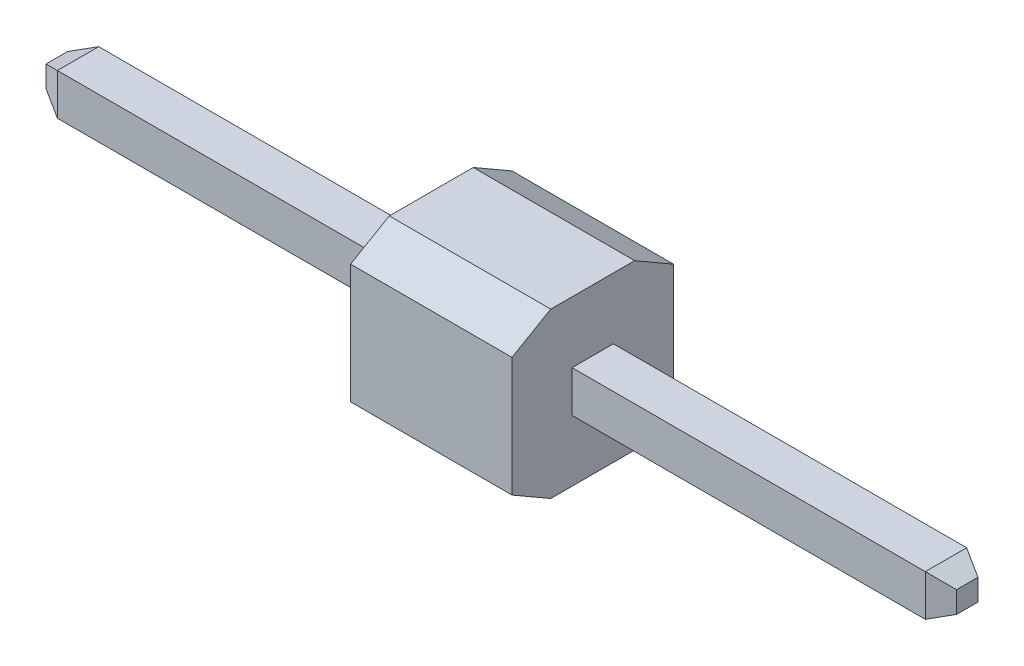
ISO-10303-21;
HEADER;
FILE_DESCRIPTION(('STEP AP214'),'2;1');
FILE_NAME('part.step','',(''),(''),'','','');
FILE_SCHEMA(('AUTOMOTIVE_DESIGN { 1 0 10303 214 1 1 1 1 }'));
ENDSEC;
DATA;
#1=APPLICATION_CONTEXT('core data for automotive mechanical design processes');
#2=APPLICATION_PROTOCOL_DEFINITION('international standard','automotive_design',2000,#1);
#3=PRODUCT_CONTEXT('',#1,'mechanical');
#4=PRODUCT('Part','Part','',(#3));
#5=PRODUCT_RELATED_PRODUCT_CATEGORY('part','',(#4));
#6=PRODUCT_DEFINITION_FORMATION('','',#4);
#7=PRODUCT_DEFINITION_CONTEXT('part definition',#1,'design');
#8=PRODUCT_DEFINITION('design','',#6,#7);
#9=PRODUCT_DEFINITION_SHAPE('','',#8);
#10=(LENGTH_UNIT() NAMED_UNIT(*) SI_UNIT(.MILLI.,.METRE.));
#11=(NAMED_UNIT(*) PLANE_ANGLE_UNIT() SI_UNIT($,.RADIAN.));
#12=(NAMED_UNIT(*) SI_UNIT($,.STERADIAN.) SOLID_ANGLE_UNIT());
#13=UNCERTAINTY_MEASURE_WITH_UNIT(LENGTH_MEASURE(1.E-05),#10,'distance_accuracy_value','');
#14=(GEOMETRIC_REPRESENTATION_CONTEXT(3) GLOBAL_UNCERTAINTY_ASSIGNED_CONTEXT((#13)) GLOBAL_UNIT_ASSIGNED_CONTEXT((#10,
#11,#12)) REPRESENTATION_CONTEXT('',''));
#15=CARTESIAN_POINT('',(0.,0.,0.));
#16=DIRECTION('',(0.,0.,1.));
#17=DIRECTION('',(1.,0.,0.));
#18=AXIS2_PLACEMENT_3D('',#15,#16,#17);
#19=CARTESIAN_POINT('',(5.42107439041138,12.3828784128063,0.629998634255617));
#20=DIRECTION('',(1.,4.37113882867379E-08,-4.37113882867379E-08));
#21=DIRECTION('',(-4.37113882867379E-08,1.,0.));
#22=AXIS2_PLACEMENT_3D('',#19,#20,#21);
#23=PLANE('',#22);
#24=DIRECTION('',(1.59994790123753E-08,0.50000000000019,0.866025403784329));
#25=VECTOR('',#24,1.);
#26=CARTESIAN_POINT('',(5.42107426742546,13.6264682512923,-0.940001365744382));
#27=LINE('',#26,#25);
#28=CARTESIAN_POINT('',(5.42107426742546,13.6264682512923,-0.940001365744382));
#29=VERTEX_POINT('',#28);
#30=CARTESIAN_POINT('',(5.42107427851022,13.9728784128063,-0.340001365744383));
#31=VERTEX_POINT('',#30);
#32=EDGE_CURVE('E11',#29,#31,#27,.T.);
#33=ORIENTED_EDGE('',*,*,#32,.T.);
#34=DIRECTION('',(4.37113886966664E-08,0.,0.999999999999999));
#35=VECTOR('',#34,1.);
#36=CARTESIAN_POINT('',(5.42107427851022,13.9728784128063,-0.340001365744383));
#37=LINE('',#36,#35);
#38=CARTESIAN_POINT('',(5.42107433533503,13.9728784128063,0.959998634255618));
#39=VERTEX_POINT('',#38);
#40=EDGE_CURVE('E304',#31,#39,#37,.T.);
#41=ORIENTED_EDGE('',*,*,#40,.T.);
#42=DIRECTION('',(5.97108656004285E-08,-0.500000000000188,0.866025403784328));
#43=VECTOR('',#42,1.);
#44=CARTESIAN_POINT('',(5.42107433533503,13.9728784128063,0.959998634255618));
#45=LINE('',#44,#43);
#46=CARTESIAN_POINT('',(5.42107437670393,13.6264682512923,1.55999863425562));
#47=VERTEX_POINT('',#46);
#48=EDGE_CURVE('E296',#39,#47,#45,.T.);
#49=ORIENTED_EDGE('',*,*,#48,.T.);
#50=DIRECTION('',(4.37113884815071E-08,-0.999999999999999,0.));
#51=VECTOR('',#50,1.);
#52=CARTESIAN_POINT('',(5.42107437670393,13.6264682512923,1.55999863425562));
#53=LINE('',#52,#51);
#54=CARTESIAN_POINT('',(5.42107445744672,11.7792885743203,1.55999863425562));
#55=VERTEX_POINT('',#54);
#56=EDGE_CURVE('E281',#47,#55,#53,.T.);
#57=ORIENTED_EDGE('',*,*,#56,.T.);
#58=DIRECTION('',(1.59994777304001E-08,0.50000000000019,0.866025403784329));
#59=VECTOR('',#58,1.);
#60=CARTESIAN_POINT('',(5.42107444636195,11.4328784128063,0.959998634255618));
#61=LINE('',#60,#59);
#62=CARTESIAN_POINT('',(5.42107444636195,11.4328784128063,0.959998634255618));
#63=VERTEX_POINT('',#62);
#64=EDGE_CURVE('E265',#63,#55,#61,.T.);
#65=ORIENTED_EDGE('',*,*,#64,.F.);
#66=DIRECTION('',(4.37113886966664E-08,0.,0.999999999999999));
#67=VECTOR('',#66,1.);
#68=CARTESIAN_POINT('',(5.42107438953715,11.4328784128063,-0.340001365744383));
#69=LINE('',#68,#67);
#70=CARTESIAN_POINT('',(5.42107438953715,11.4328784128063,-0.340001365744383));
#71=VERTEX_POINT('',#70);
#72=EDGE_CURVE('E248',#71,#63,#69,.T.);
#73=ORIENTED_EDGE('',*,*,#72,.F.);
#74=DIRECTION('',(5.97108668824036E-08,-0.500000000000188,0.866025403784328));
#75=VECTOR('',#74,1.);
#76=CARTESIAN_POINT('',(5.42107434816825,11.7792885743203,-0.940001365744382));
#77=LINE('',#76,#75);
#78=CARTESIAN_POINT('',(5.42107434816825,11.7792885743203,-0.940001365744382));
#79=VERTEX_POINT('',#78);
#80=EDGE_CURVE('E242',#79,#71,#77,.T.);
#81=ORIENTED_EDGE('',*,*,#80,.F.);
#82=DIRECTION('',(4.37113884815071E-08,-0.999999999999999,0.));
#83=VECTOR('',#82,1.);
#84=CARTESIAN_POINT('',(5.42107426742546,13.6264682512923,-0.940001365744382));
#85=LINE('',#84,#83);
#86=EDGE_CURVE('E236',#29,#79,#85,.T.);
#87=ORIENTED_EDGE('',*,*,#86,.F.);
#88=EDGE_LOOP('',(#33,#41,#49,#57,#65,#73,#81,#87));
#89=FACE_BOUND('',#88,.T.);
#90=DIRECTION('',(-4.37113900630947E-08,0.,-0.999999999999999));
#91=VECTOR('',#90,1.);
#92=CARTESIAN_POINT('',(5.42107436243609,13.0228784128063,0.629998634255617));
#93=LINE('',#92,#91);
#94=CARTESIAN_POINT('',(5.42107436243609,13.0228784128063,0.629998634255617));
#95=VERTEX_POINT('',#94);
#96=CARTESIAN_POINT('',(5.4210743344608,13.0228784128063,-0.0100013657443826));
#97=VERTEX_POINT('',#96);
#98=EDGE_CURVE('E302',#95,#97,#93,.T.);
#99=ORIENTED_EDGE('',*,*,#98,.T.);
#100=DIRECTION('',(-4.37113900630947E-08,0.999999999999999,0.));
#101=VECTOR('',#100,1.);
#102=CARTESIAN_POINT('',(5.42107436243609,12.3828784128063,-0.0100013657443826));
#103=LINE('',#102,#101);
#104=CARTESIAN_POINT('',(5.42107436243609,12.3828784128063,-0.0100013657443826));
#105=VERTEX_POINT('',#104);
#106=EDGE_CURVE('E293',#105,#97,#103,.T.);
#107=ORIENTED_EDGE('',*,*,#106,.F.);
#108=DIRECTION('',(-4.37113872875372E-08,0.,-0.999999999999999));
#109=VECTOR('',#108,1.);
#110=CARTESIAN_POINT('',(5.42107439041138,12.3828784128063,0.629998634255617));
#111=LINE('',#110,#109);
#112=CARTESIAN_POINT('',(5.42107439041138,12.3828784128063,0.629998634255617));
#113=VERTEX_POINT('',#112);
#114=EDGE_CURVE('E278',#113,#105,#111,.T.);
#115=ORIENTED_EDGE('',*,*,#114,.F.);
#116=DIRECTION('',(-4.37113872875371E-08,0.999999999999999,0.));
#117=VECTOR('',#116,1.);
#118=CARTESIAN_POINT('',(5.42107439041138,12.3828784128063,0.629998634255617));
#119=LINE('',#118,#117);
#120=EDGE_CURVE('E263',#113,#95,#119,.T.);
#121=ORIENTED_EDGE('',*,*,#120,.T.);
#122=EDGE_LOOP('',(#99,#107,#115,#121));
#123=FACE_BOUND('',#122,.T.);
#124=ADVANCED_FACE('F17',(#89,#123),#23,.T.);
#125=CARTESIAN_POINT('',(2.92107439041138,12.3828783035278,0.629998743534088));
#126=DIRECTION('',(1.,4.37113882867379E-08,-4.37113882867379E-08));
#127=DIRECTION('',(-4.37113882867379E-08,1.,0.));
#128=AXIS2_PLACEMENT_3D('',#125,#126,#127);
#129=PLANE('',#128);
#130=DIRECTION('',(1.59994783713877E-08,0.50000000000019,0.866025403784329));
#131=VECTOR('',#130,1.);
#132=CARTESIAN_POINT('',(2.92107426742546,13.6264681420138,-0.940001256465912));
#133=LINE('',#132,#131);
#134=CARTESIAN_POINT('',(2.92107426742546,13.6264681420138,-0.940001256465912));
#135=VERTEX_POINT('',#134);
#136=CARTESIAN_POINT('',(2.92107427851022,13.9728783035278,-0.340001256465912));
#137=VERTEX_POINT('',#136);
#138=EDGE_CURVE('E24',#135,#137,#133,.T.);
#139=ORIENTED_EDGE('',*,*,#138,.F.);
#140=DIRECTION('',(4.37113882410924E-08,-0.999999999999999,0.));
#141=VECTOR('',#140,1.);
#142=CARTESIAN_POINT('',(2.92107426742546,13.6264681420138,-0.940001256465912));
#143=LINE('',#142,#141);
#144=CARTESIAN_POINT('',(2.92107434816825,11.7792884650418,-0.940001256465912));
#145=VERTEX_POINT('',#144);
#146=EDGE_CURVE('E300',#135,#145,#143,.T.);
#147=ORIENTED_EDGE('',*,*,#146,.T.);
#148=DIRECTION('',(5.97108668824036E-08,-0.500000000000188,0.866025403784328));
#149=VECTOR('',#148,1.);
#150=CARTESIAN_POINT('',(2.92107434816825,11.7792884650418,-0.940001256465912));
#151=LINE('',#150,#149);
#152=CARTESIAN_POINT('',(2.92107438953715,11.4328783035278,-0.340001256465912));
#153=VERTEX_POINT('',#152);
#154=EDGE_CURVE('E286',#145,#153,#151,.T.);
#155=ORIENTED_EDGE('',*,*,#154,.T.);
#156=DIRECTION('',(4.37113883550593E-08,0.,0.999999999999999));
#157=VECTOR('',#156,1.);
#158=CARTESIAN_POINT('',(2.92107438953715,11.4328783035278,-0.340001256465912));
#159=LINE('',#158,#157);
#160=CARTESIAN_POINT('',(2.92107444636195,11.4328783035278,0.959998743534088));
#161=VERTEX_POINT('',#160);
#162=EDGE_CURVE('E271',#153,#161,#159,.T.);
#163=ORIENTED_EDGE('',*,*,#162,.T.);
#164=DIRECTION('',(1.59994783713877E-08,0.50000000000019,0.866025403784329));
#165=VECTOR('',#164,1.);
#166=CARTESIAN_POINT('',(2.92107444636195,11.4328783035278,0.959998743534088));
#167=LINE('',#166,#165);
#168=CARTESIAN_POINT('',(2.92107445744672,11.7792884650418,1.55999874353409));
#169=VERTEX_POINT('',#168);
#170=EDGE_CURVE('E253',#161,#169,#167,.T.);
#171=ORIENTED_EDGE('',*,*,#170,.T.);
#172=DIRECTION('',(4.37113882410924E-08,-0.999999999999999,0.));
#173=VECTOR('',#172,1.);
#174=CARTESIAN_POINT('',(2.92107437670393,13.6264681420138,1.55999874353409));
#175=LINE('',#174,#173);
#176=CARTESIAN_POINT('',(2.92107437670393,13.6264681420138,1.55999874353409));
#177=VERTEX_POINT('',#176);
#178=EDGE_CURVE('E261',#177,#169,#175,.T.);
#179=ORIENTED_EDGE('',*,*,#178,.F.);
#180=DIRECTION('',(5.97108668824036E-08,-0.500000000000188,0.866025403784328));
#181=VECTOR('',#180,1.);
#182=CARTESIAN_POINT('',(2.92107433533503,13.9728783035278,0.959998743534088));
#183=LINE('',#182,#181);
#184=CARTESIAN_POINT('',(2.92107433533503,13.9728783035278,0.959998743534088));
#185=VERTEX_POINT('',#184);
#186=EDGE_CURVE('E276',#185,#177,#183,.T.);
#187=ORIENTED_EDGE('',*,*,#186,.F.);
#188=DIRECTION('',(4.37113883550593E-08,0.,0.999999999999999));
#189=VECTOR('',#188,1.);
#190=CARTESIAN_POINT('',(2.92107427851022,13.9728783035278,-0.340001256465912));
#191=LINE('',#190,#189);
#192=EDGE_CURVE('E291',#137,#185,#191,.T.);
#193=ORIENTED_EDGE('',*,*,#192,.F.);
#194=EDGE_LOOP('',(#139,#147,#155,#163,#171,#179,#187,#193));
#195=FACE_BOUND('',#194,.T.);
#196=DIRECTION('',(-4.37113886753159E-08,0.999999999999999,0.));
#197=VECTOR('',#196,1.);
#198=CARTESIAN_POINT('',(2.92107436243609,12.3828783035278,-0.0100012564659119));
#199=LINE('',#198,#197);
#200=CARTESIAN_POINT('',(2.92107436243609,12.3828783035278,-0.0100012564659119));
#201=VERTEX_POINT('',#200);
#202=CARTESIAN_POINT('',(2.9210743344608,13.0228783035278,-0.0100012564659119));
#203=VERTEX_POINT('',#202);
#204=EDGE_CURVE('E298',#201,#203,#199,.T.);
#205=ORIENTED_EDGE('',*,*,#204,.T.);
#206=DIRECTION('',(-4.37113886753159E-08,0.,-0.999999999999999));
#207=VECTOR('',#206,1.);
#208=CARTESIAN_POINT('',(2.92107436243609,13.0228783035278,0.629998743534088));
#209=LINE('',#208,#207);
#210=CARTESIAN_POINT('',(2.92107436243609,13.0228783035278,0.629998743534088));
#211=VERTEX_POINT('',#210);
#212=EDGE_CURVE('E283',#211,#203,#209,.T.);
#213=ORIENTED_EDGE('',*,*,#212,.F.);
#214=DIRECTION('',(-4.37113879814265E-08,0.999999999999999,0.));
#215=VECTOR('',#214,1.);
#216=CARTESIAN_POINT('',(2.92107439041138,12.3828783035278,0.629998743534088));
#217=LINE('',#216,#215);
#218=CARTESIAN_POINT('',(2.92107439041138,12.3828783035278,0.629998743534088));
#219=VERTEX_POINT('',#218);
#220=EDGE_CURVE('E268',#219,#211,#217,.T.);
#221=ORIENTED_EDGE('',*,*,#220,.F.);
#222=DIRECTION('',(-4.37113879814266E-08,0.,-0.999999999999999));
#223=VECTOR('',#222,1.);
#224=CARTESIAN_POINT('',(2.92107439041138,12.3828783035278,0.629998743534088));
#225=LINE('',#224,#223);
#226=EDGE_CURVE('E251',#219,#201,#225,.T.);
#227=ORIENTED_EDGE('',*,*,#226,.T.);
#228=EDGE_LOOP('',(#205,#213,#221,#227));
#229=FACE_BOUND('',#228,.T.);
#230=ADVANCED_FACE('F314',(#195,#229),#129,.F.);
#231=CARTESIAN_POINT('',(5.42107426742546,13.6264682512923,-0.940001365744382));
#232=DIRECTION('',(5.97108668343731E-08,-0.866025403784328,0.50000000000019));
#233=DIRECTION('',(-1.59994785476185E-08,-0.500000000000192,-0.866025403784329));
#234=AXIS2_PLACEMENT_3D('',#231,#232,#233);
#235=PLANE('',#234);
#236=ORIENTED_EDGE('',*,*,#138,.T.);
#237=DIRECTION('',(-0.999999999999998,-4.37113882867378E-08,4.37113883755557E-08));
#238=VECTOR('',#237,1.);
#239=CARTESIAN_POINT('',(5.42107427851022,13.9728784128063,-0.340001365744383));
#240=LINE('',#239,#238);
#241=EDGE_CURVE('E288',#31,#137,#240,.T.);
#242=ORIENTED_EDGE('',*,*,#241,.F.);
#243=ORIENTED_EDGE('',*,*,#32,.F.);
#244=DIRECTION('',(-0.999999999999998,-4.37113882867378E-08,4.37113881091022E-08));
#245=VECTOR('',#244,1.);
#246=CARTESIAN_POINT('',(5.42107426742546,13.6264682512923,-0.940001365744382));
#247=LINE('',#246,#245);
#248=EDGE_CURVE('E256',#29,#135,#247,.T.);
#249=ORIENTED_EDGE('',*,*,#248,.T.);
#250=EDGE_LOOP('',(#236,#242,#243,#249));
#251=FACE_BOUND('',#250,.T.);
#252=ADVANCED_FACE('F306',(#251),#235,.F.);
#253=CARTESIAN_POINT('',(5.42107427851022,13.9728784128063,-0.340001365744383));
#254=DIRECTION('',(4.37113882867379E-08,-1.,0.));
#255=DIRECTION('',(1.,4.37113882867379E-08,-4.37113882867379E-08));
#256=AXIS2_PLACEMENT_3D('',#253,#254,#255);
#257=PLANE('',#256);
#258=ORIENTED_EDGE('',*,*,#192,.T.);
#259=DIRECTION('',(-0.999999999999998,-4.37113882867378E-08,4.37113882867378E-08));
#260=VECTOR('',#259,1.);
#261=CARTESIAN_POINT('',(5.42107433533503,13.9728784128063,0.959998634255618));
#262=LINE('',#261,#260);
#263=EDGE_CURVE('E273',#39,#185,#262,.T.);
#264=ORIENTED_EDGE('',*,*,#263,.F.);
#265=ORIENTED_EDGE('',*,*,#40,.F.);
#266=ORIENTED_EDGE('',*,*,#241,.T.);
#267=EDGE_LOOP('',(#258,#264,#265,#266));
#268=FACE_BOUND('',#267,.T.);
#269=ADVANCED_FACE('F311',(#268),#257,.F.);
#270=CARTESIAN_POINT('',(5.42107433533503,13.9728784128063,0.959998634255618));
#271=DIRECTION('',(1.59994785476185E-08,-0.86602540378433,-0.50000000000019));
#272=DIRECTION('',(-5.97108668343731E-08,0.500000000000188,-0.866025403784329));
#273=AXIS2_PLACEMENT_3D('',#270,#271,#272);
#274=PLANE('',#273);
#275=ORIENTED_EDGE('',*,*,#186,.T.);
#276=DIRECTION('',(-0.999999999999998,-4.37113882867378E-08,4.37113882867378E-08));
#277=VECTOR('',#276,1.);
#278=CARTESIAN_POINT('',(5.42107437670393,13.6264682512923,1.55999863425562));
#279=LINE('',#278,#277);
#280=EDGE_CURVE('E258',#47,#177,#279,.T.);
#281=ORIENTED_EDGE('',*,*,#280,.F.);
#282=ORIENTED_EDGE('',*,*,#48,.F.);
#283=ORIENTED_EDGE('',*,*,#263,.T.);
#284=EDGE_LOOP('',(#275,#281,#282,#283));
#285=FACE_BOUND('',#284,.T.);
#286=ADVANCED_FACE('F319',(#285),#274,.F.);
#287=CARTESIAN_POINT('',(5.42107437670393,13.6264682512923,1.55999863425562));
#288=DIRECTION('',(-4.37113882867379E-08,0.,-1.));
#289=DIRECTION('',(-1.,-4.37113882867379E-08,4.37113882867379E-08));
#290=AXIS2_PLACEMENT_3D('',#287,#288,#289);
#291=PLANE('',#290);
#292=ORIENTED_EDGE('',*,*,#178,.T.);
#293=DIRECTION('',(-0.999999999999998,-4.37113882867378E-08,4.37113882867378E-08));
#294=VECTOR('',#293,1.);
#295=CARTESIAN_POINT('',(5.42107445744672,11.7792885743203,1.55999863425562));
#296=LINE('',#295,#294);
#297=EDGE_CURVE('E245',#55,#169,#296,.T.);
#298=ORIENTED_EDGE('',*,*,#297,.F.);
#299=ORIENTED_EDGE('',*,*,#56,.F.);
#300=ORIENTED_EDGE('',*,*,#280,.T.);
#301=EDGE_LOOP('',(#292,#298,#299,#300));
#302=FACE_BOUND('',#301,.T.);
#303=ADVANCED_FACE('F326',(#302),#291,.F.);
#304=CARTESIAN_POINT('',(5.42107444636195,11.4328784128063,0.959998634255618));
#305=DIRECTION('',(5.97108668343731E-08,-0.866025403784328,0.50000000000019));
#306=DIRECTION('',(-1.59994785476185E-08,-0.500000000000192,-0.866025403784329));
#307=AXIS2_PLACEMENT_3D('',#304,#305,#306);
#308=PLANE('',#307);
#309=ORIENTED_EDGE('',*,*,#170,.F.);
#310=DIRECTION('',(-0.999999999999998,-4.37113882867378E-08,4.37113882867378E-08));
#311=VECTOR('',#310,1.);
#312=CARTESIAN_POINT('',(5.42107444636195,11.4328784128063,0.959998634255618));
#313=LINE('',#312,#311);
#314=EDGE_CURVE('E239',#63,#161,#313,.T.);
#315=ORIENTED_EDGE('',*,*,#314,.F.);
#316=ORIENTED_EDGE('',*,*,#64,.T.);
#317=ORIENTED_EDGE('',*,*,#297,.T.);
#318=EDGE_LOOP('',(#309,#315,#316,#317));
#319=FACE_BOUND('',#318,.T.);
#320=ADVANCED_FACE('F329',(#319),#308,.T.);
#321=CARTESIAN_POINT('',(5.42107438953715,11.4328784128063,-0.340001365744383));
#322=DIRECTION('',(4.37113882867379E-08,-1.,0.));
#323=DIRECTION('',(1.,4.37113882867379E-08,-4.37113882867379E-08));
#324=AXIS2_PLACEMENT_3D('',#321,#322,#323);
#325=PLANE('',#324);
#326=ORIENTED_EDGE('',*,*,#162,.F.);
#327=DIRECTION('',(-0.999999999999998,-4.37113889972806E-08,4.37113883755557E-08));
#328=VECTOR('',#327,1.);
#329=CARTESIAN_POINT('',(5.42107438953715,11.4328784128063,-0.340001365744383));
#330=LINE('',#329,#328);
#331=EDGE_CURVE('E233',#71,#153,#330,.T.);
#332=ORIENTED_EDGE('',*,*,#331,.F.);
#333=ORIENTED_EDGE('',*,*,#72,.T.);
#334=ORIENTED_EDGE('',*,*,#314,.T.);
#335=EDGE_LOOP('',(#326,#332,#333,#334));
#336=FACE_BOUND('',#335,.T.);
#337=ADVANCED_FACE('F333',(#336),#325,.T.);
#338=CARTESIAN_POINT('',(5.42107434816825,11.7792885743203,-0.940001365744382));
#339=DIRECTION('',(1.59994785476185E-08,-0.86602540378433,-0.50000000000019));
#340=DIRECTION('',(-5.97108668343731E-08,0.500000000000188,-0.866025403784329));
#341=AXIS2_PLACEMENT_3D('',#338,#339,#340);
#342=PLANE('',#341);
#343=ORIENTED_EDGE('',*,*,#154,.F.);
#344=DIRECTION('',(-0.999999999999998,-4.37113882867378E-08,4.37113881091022E-08));
#345=VECTOR('',#344,1.);
#346=CARTESIAN_POINT('',(5.42107434816825,11.7792885743203,-0.940001365744382));
#347=LINE('',#346,#345);
#348=EDGE_CURVE('E230',#79,#145,#347,.T.);
#349=ORIENTED_EDGE('',*,*,#348,.F.);
#350=ORIENTED_EDGE('',*,*,#80,.T.);
#351=ORIENTED_EDGE('',*,*,#331,.T.);
#352=EDGE_LOOP('',(#343,#349,#350,#351));
#353=FACE_BOUND('',#352,.T.);
#354=ADVANCED_FACE('F337',(#353),#342,.T.);
#355=CARTESIAN_POINT('',(5.42107426742546,13.6264682512923,-0.940001365744382));
#356=DIRECTION('',(-4.37113882867379E-08,0.,-1.));
#357=DIRECTION('',(-4.37113882867379E-08,1.,0.));
#358=AXIS2_PLACEMENT_3D('',#355,#356,#357);
#359=PLANE('',#358);
#360=ORIENTED_EDGE('',*,*,#146,.F.);
#361=ORIENTED_EDGE('',*,*,#248,.F.);
#362=ORIENTED_EDGE('',*,*,#86,.T.);
#363=ORIENTED_EDGE('',*,*,#348,.T.);
#364=EDGE_LOOP('',(#360,#361,#362,#363));
#365=FACE_BOUND('',#364,.T.);
#366=ADVANCED_FACE('F339',(#365),#359,.T.);
#367=CARTESIAN_POINT('',(-2.87892560958862,12.3828780500018,0.62999899706014));
#368=DIRECTION('',(-1.,-4.37113882867379E-08,4.37113882867379E-08));
#369=DIRECTION('',(4.37113882867379E-08,-1.,0.));
#370=AXIS2_PLACEMENT_3D('',#367,#368,#369);
#371=PLANE('',#370);
#372=DIRECTION('',(4.37113927480282E-08,-0.999999999999999,0.));
#373=VECTOR('',#372,1.);
#374=CARTESIAN_POINT('',(-2.87892565208645,12.8689965228108,0.14388052425114));
#375=LINE('',#374,#373);
#376=CARTESIAN_POINT('',(-2.87892565208645,12.8689965228108,0.14388052425114));
#377=VERTEX_POINT('',#376);
#378=CARTESIAN_POINT('',(-2.87892563756391,12.5367595771928,0.14388052425114));
#379=VERTEX_POINT('',#378);
#380=EDGE_CURVE('E228',#377,#379,#375,.T.);
#381=ORIENTED_EDGE('',*,*,#380,.T.);
#382=DIRECTION('',(4.37113900746999E-08,0.,0.999999999999999));
#383=VECTOR('',#382,1.);
#384=CARTESIAN_POINT('',(-2.87892563756391,12.5367595771928,0.14388052425114));
#385=LINE('',#384,#383);
#386=CARTESIAN_POINT('',(-2.87892562304137,12.5367595771928,0.47611746986914));
#387=VERTEX_POINT('',#386);
#388=EDGE_CURVE('E223',#379,#387,#385,.T.);
#389=ORIENTED_EDGE('',*,*,#388,.T.);
#390=DIRECTION('',(-4.37113847280434E-08,0.999999999999999,0.));
#391=VECTOR('',#390,1.);
#392=CARTESIAN_POINT('',(-2.87892562304137,12.5367595771928,0.47611746986914));
#393=LINE('',#392,#391);
#394=CARTESIAN_POINT('',(-2.87892563756391,12.8689965228108,0.47611746986914));
#395=VERTEX_POINT('',#394);
#396=EDGE_CURVE('E215',#387,#395,#393,.T.);
#397=ORIENTED_EDGE('',*,*,#396,.T.);
#398=DIRECTION('',(-4.37113820547151E-08,0.,-0.999999999999999));
#399=VECTOR('',#398,1.);
#400=CARTESIAN_POINT('',(-2.87892563756391,12.8689965228108,0.47611746986914));
#401=LINE('',#400,#399);
#402=EDGE_CURVE('E207',#395,#377,#401,.T.);
#403=ORIENTED_EDGE('',*,*,#402,.T.);
#404=EDGE_LOOP('',(#381,#389,#397,#403));
#405=FACE_BOUND('',#404,.T.);
#406=ADVANCED_FACE('F341',(#405),#371,.T.);
#407=CARTESIAN_POINT('',(-2.87892560958862,12.3828780500018,0.62999899706014));
#408=DIRECTION('',(4.37113882867379E-08,-1.,0.));
#409=DIRECTION('',(-4.37113882867379E-08,0.,-1.));
#410=AXIS2_PLACEMENT_3D('',#407,#408,#409);
#411=PLANE('',#410);
#412=DIRECTION('',(0.999999999999998,4.37113881958092E-08,-4.37113882769955E-08));
#413=VECTOR('',#412,1.);
#414=CARTESIAN_POINT('',(-2.54892560958862,12.3828780644265,0.629998982635382));
#415=LINE('',#414,#413);
#416=CARTESIAN_POINT('',(-2.54892560958862,12.3828780644265,0.629998982635382));
#417=VERTEX_POINT('',#416);
#418=EDGE_CURVE('E225',#417,#219,#415,.T.);
#419=ORIENTED_EDGE('',*,*,#418,.F.);
#420=DIRECTION('',(-4.37113886753159E-08,0.,-0.999999999999999));
#421=VECTOR('',#420,1.);
#422=CARTESIAN_POINT('',(-2.54892560958862,12.3828780644265,0.629998982635382));
#423=LINE('',#422,#421);
#424=CARTESIAN_POINT('',(-2.54892563756391,12.3828780644265,-0.010001017364618));
#425=VERTEX_POINT('',#424);
#426=EDGE_CURVE('E217',#417,#425,#423,.T.);
#427=ORIENTED_EDGE('',*,*,#426,.T.);
#428=DIRECTION('',(0.999999999999998,4.37113881958092E-08,-4.37113882161057E-08));
#429=VECTOR('',#428,1.);
#430=CARTESIAN_POINT('',(-2.54892563756391,12.3828780644265,-0.010001017364618));
#431=LINE('',#430,#429);
#432=EDGE_CURVE('E220',#425,#201,#431,.T.);
#433=ORIENTED_EDGE('',*,*,#432,.T.);
#434=ORIENTED_EDGE('',*,*,#226,.F.);
#435=EDGE_LOOP('',(#419,#427,#433,#434));
#436=FACE_BOUND('',#435,.T.);
#437=ADVANCED_FACE('F348',(#436),#411,.T.);
#438=CARTESIAN_POINT('',(-2.87892563756391,12.3828780500018,-0.0100010029398598));
#439=DIRECTION('',(-4.37113882867379E-08,0.,-1.));
#440=DIRECTION('',(-1.,-4.37113882867379E-08,4.37113882867379E-08));
#441=AXIS2_PLACEMENT_3D('',#438,#439,#440);
#442=PLANE('',#441);
#443=ORIENTED_EDGE('',*,*,#432,.F.);
#444=DIRECTION('',(-4.37113872875371E-08,0.999999999999999,0.));
#445=VECTOR('',#444,1.);
#446=CARTESIAN_POINT('',(-2.54892563756391,12.3828780644265,-0.010001017364618));
#447=LINE('',#446,#445);
#448=CARTESIAN_POINT('',(-2.5489256655392,13.0228780644265,-0.010001017364618));
#449=VERTEX_POINT('',#448);
#450=EDGE_CURVE('E209',#425,#449,#447,.T.);
#451=ORIENTED_EDGE('',*,*,#450,.T.);
#452=DIRECTION('',(0.999999999999998,4.37113881958092E-08,-4.37113882161058E-08));
#453=VECTOR('',#452,1.);
#454=CARTESIAN_POINT('',(-2.5489256655392,13.0228780644265,-0.010001017364618));
#455=LINE('',#454,#453);
#456=EDGE_CURVE('E212',#449,#203,#455,.T.);
#457=ORIENTED_EDGE('',*,*,#456,.T.);
#458=ORIENTED_EDGE('',*,*,#204,.F.);
#459=EDGE_LOOP('',(#443,#451,#457,#458));
#460=FACE_BOUND('',#459,.T.);
#461=ADVANCED_FACE('F424',(#460),#442,.T.);
#462=CARTESIAN_POINT('',(-2.87892563756391,13.0228780500018,0.62999899706014));
#463=DIRECTION('',(4.37113882867379E-08,-1.,0.));
#464=DIRECTION('',(-4.37113882867379E-08,0.,-1.));
#465=AXIS2_PLACEMENT_3D('',#462,#463,#464);
#466=PLANE('',#465);
#467=ORIENTED_EDGE('',*,*,#456,.F.);
#468=DIRECTION('',(4.37113886753159E-08,0.,0.999999999999999));
#469=VECTOR('',#468,1.);
#470=CARTESIAN_POINT('',(-2.5489256655392,13.0228780644265,-0.010001017364618));
#471=LINE('',#470,#469);
#472=CARTESIAN_POINT('',(-2.54892563756391,13.0228780644265,0.629998982635382));
#473=VERTEX_POINT('',#472);
#474=EDGE_CURVE('E201',#449,#473,#471,.T.);
#475=ORIENTED_EDGE('',*,*,#474,.T.);
#476=DIRECTION('',(0.999999999999998,4.37113885205545E-08,-4.37113882769955E-08));
#477=VECTOR('',#476,1.);
#478=CARTESIAN_POINT('',(-2.54892563756391,13.0228780644265,0.629998982635382));
#479=LINE('',#478,#477);
#480=EDGE_CURVE('E204',#473,#211,#479,.T.);
#481=ORIENTED_EDGE('',*,*,#480,.T.);
#482=ORIENTED_EDGE('',*,*,#212,.T.);
#483=EDGE_LOOP('',(#467,#475,#481,#482));
#484=FACE_BOUND('',#483,.T.);
#485=ADVANCED_FACE('F421',(#484),#466,.F.);
#486=CARTESIAN_POINT('',(-2.87892560958862,12.3828780500018,0.62999899706014));
#487=DIRECTION('',(-4.37113882867379E-08,0.,-1.));
#488=DIRECTION('',(-1.,-4.37113882867379E-08,4.37113882867379E-08));
#489=AXIS2_PLACEMENT_3D('',#486,#487,#488);
#490=PLANE('',#489);
#491=ORIENTED_EDGE('',*,*,#480,.F.);
#492=DIRECTION('',(4.37113900630948E-08,-0.999999999999999,0.));
#493=VECTOR('',#492,1.);
#494=CARTESIAN_POINT('',(-2.54892563756391,13.0228780644265,0.629998982635382));
#495=LINE('',#494,#493);
#496=EDGE_CURVE('E196',#473,#417,#495,.T.);
#497=ORIENTED_EDGE('',*,*,#496,.T.);
#498=ORIENTED_EDGE('',*,*,#418,.T.);
#499=ORIENTED_EDGE('',*,*,#220,.T.);
#500=EDGE_LOOP('',(#491,#497,#498,#499));
#501=FACE_BOUND('',#500,.T.);
#502=ADVANCED_FACE('F376',(#501),#490,.F.);
#503=CARTESIAN_POINT('',(-2.87892560958862,12.3828780500018,0.62999899706014));
#504=DIRECTION('',(-4.37113882867379E-08,0.,-1.));
#505=DIRECTION('',(-1.,-4.37113882867379E-08,4.37113882867379E-08));
#506=AXIS2_PLACEMENT_3D('',#503,#504,#505);
#507=PLANE('',#506);
#508=DIRECTION('',(0.999999999999998,4.37113881958092E-08,-4.37113882769955E-08));
#509=VECTOR('',#508,1.);
#510=CARTESIAN_POINT('',(5.42107439041138,12.3828784128063,0.629998634255617));
#511=LINE('',#510,#509);
#512=CARTESIAN_POINT('',(10.8910743904114,12.3828786519076,0.629998395154324));
#513=VERTEX_POINT('',#512);
#514=EDGE_CURVE('E199',#113,#513,#511,.T.);
#515=ORIENTED_EDGE('',*,*,#514,.T.);
#516=DIRECTION('',(-4.37113900630947E-08,0.999999999999999,0.));
#517=VECTOR('',#516,1.);
#518=CARTESIAN_POINT('',(10.8910743904114,12.3828786519076,0.629998395154324));
#519=LINE('',#518,#517);
#520=CARTESIAN_POINT('',(10.8910743624361,13.0228786519076,0.629998395154324));
#521=VERTEX_POINT('',#520);
#522=EDGE_CURVE('E191',#513,#521,#519,.T.);
#523=ORIENTED_EDGE('',*,*,#522,.T.);
#524=DIRECTION('',(0.999999999999998,4.37113878710639E-08,-4.37113882769955E-08));
#525=VECTOR('',#524,1.);
#526=CARTESIAN_POINT('',(5.42107436243609,13.0228784128063,0.629998634255617));
#527=LINE('',#526,#525);
#528=EDGE_CURVE('E194',#95,#521,#527,.T.);
#529=ORIENTED_EDGE('',*,*,#528,.F.);
#530=ORIENTED_EDGE('',*,*,#120,.F.);
#531=EDGE_LOOP('',(#515,#523,#529,#530));
#532=FACE_BOUND('',#531,.T.);
#533=ADVANCED_FACE('F367',(#532),#507,.F.);
#534=CARTESIAN_POINT('',(-2.87892563756391,13.0228780500018,0.62999899706014));
#535=DIRECTION('',(4.37113882867379E-08,-1.,0.));
#536=DIRECTION('',(-4.37113882867379E-08,0.,-1.));
#537=AXIS2_PLACEMENT_3D('',#534,#535,#536);
#538=PLANE('',#537);
#539=ORIENTED_EDGE('',*,*,#528,.T.);
#540=DIRECTION('',(-4.37113872875372E-08,0.,-0.999999999999999));
#541=VECTOR('',#540,1.);
#542=CARTESIAN_POINT('',(10.8910743624361,13.0228786519076,0.629998395154324));
#543=LINE('',#542,#541);
#544=CARTESIAN_POINT('',(10.8910743344608,13.0228786519076,-0.0100016048456765));
#545=VERTEX_POINT('',#544);
#546=EDGE_CURVE('E186',#521,#545,#543,.T.);
#547=ORIENTED_EDGE('',*,*,#546,.T.);
#548=DIRECTION('',(0.999999999999998,4.37113881958092E-08,-4.37113881146228E-08));
#549=VECTOR('',#548,1.);
#550=CARTESIAN_POINT('',(5.4210743344608,13.0228784128063,-0.0100013657443823));
#551=LINE('',#550,#549);
#552=EDGE_CURVE('E189',#97,#545,#551,.T.);
#553=ORIENTED_EDGE('',*,*,#552,.F.);
#554=ORIENTED_EDGE('',*,*,#98,.F.);
#555=EDGE_LOOP('',(#539,#547,#553,#554));
#556=FACE_BOUND('',#555,.T.);
#557=ADVANCED_FACE('F364',(#556),#538,.F.);
#558=CARTESIAN_POINT('',(-2.87892563756391,12.3828780500018,-0.0100010029398598));
#559=DIRECTION('',(-4.37113882867379E-08,0.,-1.));
#560=DIRECTION('',(-1.,-4.37113882867379E-08,4.37113882867379E-08));
#561=AXIS2_PLACEMENT_3D('',#558,#559,#560);
#562=PLANE('',#561);
#563=ORIENTED_EDGE('',*,*,#552,.T.);
#564=DIRECTION('',(4.37113872875372E-08,-0.999999999999999,0.));
#565=VECTOR('',#564,1.);
#566=CARTESIAN_POINT('',(10.8910743344608,13.0228786519076,-0.0100016048456764));
#567=LINE('',#566,#565);
#568=CARTESIAN_POINT('',(10.8910743624361,12.3828786519076,-0.0100016048456765));
#569=VERTEX_POINT('',#568);
#570=EDGE_CURVE('E176',#545,#569,#567,.T.);
#571=ORIENTED_EDGE('',*,*,#570,.T.);
#572=DIRECTION('',(0.999999999999998,4.37113885205545E-08,-4.37113881146229E-08));
#573=VECTOR('',#572,1.);
#574=CARTESIAN_POINT('',(5.42107436243609,12.3828784128063,-0.0100013657443823));
#575=LINE('',#574,#573);
#576=EDGE_CURVE('E179',#105,#569,#575,.T.);
#577=ORIENTED_EDGE('',*,*,#576,.F.);
#578=ORIENTED_EDGE('',*,*,#106,.T.);
#579=EDGE_LOOP('',(#563,#571,#577,#578));
#580=FACE_BOUND('',#579,.T.);
#581=ADVANCED_FACE('F366',(#580),#562,.T.);
#582=CARTESIAN_POINT('',(-2.87892560958862,12.3828780500018,0.62999899706014));
#583=DIRECTION('',(4.37113882867379E-08,-1.,0.));
#584=DIRECTION('',(-4.37113882867379E-08,0.,-1.));
#585=AXIS2_PLACEMENT_3D('',#582,#583,#584);
#586=PLANE('',#585);
#587=ORIENTED_EDGE('',*,*,#576,.T.);
#588=DIRECTION('',(4.37113845119796E-08,0.,0.999999999999999));
#589=VECTOR('',#588,1.);
#590=CARTESIAN_POINT('',(10.8910743624361,12.3828786519076,-0.0100016048456765));
#591=LINE('',#590,#589);
#592=EDGE_CURVE('E167',#569,#513,#591,.T.);
#593=ORIENTED_EDGE('',*,*,#592,.T.);
#594=ORIENTED_EDGE('',*,*,#514,.F.);
#595=ORIENTED_EDGE('',*,*,#114,.T.);
#596=EDGE_LOOP('',(#587,#593,#594,#595));
#597=FACE_BOUND('',#596,.T.);
#598=ADVANCED_FACE('F373',(#597),#586,.T.);
#599=CARTESIAN_POINT('',(11.2210743904114,12.3828786663324,0.629998380729565));
#600=DIRECTION('',(-1.,-4.37113882867379E-08,4.37113882867379E-08));
#601=DIRECTION('',(4.37113882867379E-08,-1.,0.));
#602=AXIS2_PLACEMENT_3D('',#599,#600,#601);
#603=PLANE('',#602);
#604=DIRECTION('',(-4.37113980946847E-08,0.999999999999999,0.));
#605=VECTOR('',#604,1.);
#606=CARTESIAN_POINT('',(11.2210743624361,12.5367601935234,0.143879907920565));
#607=LINE('',#606,#605);
#608=CARTESIAN_POINT('',(11.2210743624361,12.5367601935234,0.143879907920565));
#609=VERTEX_POINT('',#608);
#610=CARTESIAN_POINT('',(11.2210743479135,12.8689971391414,0.143879907920565));
#611=VERTEX_POINT('',#610);
#612=EDGE_CURVE('E153',#609,#611,#607,.T.);
#613=ORIENTED_EDGE('',*,*,#612,.T.);
#614=DIRECTION('',(4.37113927480282E-08,0.,0.999999999999999));
#615=VECTOR('',#614,1.);
#616=CARTESIAN_POINT('',(11.2210743479135,12.8689971391414,0.143879907920565));
#617=LINE('',#616,#615);
#618=CARTESIAN_POINT('',(11.2210743624361,12.8689971391414,0.476116853538565));
#619=VERTEX_POINT('',#618);
#620=EDGE_CURVE('E395',#611,#619,#617,.T.);
#621=ORIENTED_EDGE('',*,*,#620,.T.);
#622=DIRECTION('',(4.37113820547151E-08,-0.999999999999999,0.));
#623=VECTOR('',#622,1.);
#624=CARTESIAN_POINT('',(11.2210743624361,12.8689971391414,0.476116853538565));
#625=LINE('',#624,#623);
#626=CARTESIAN_POINT('',(11.2210743769586,12.5367601935234,0.476116853538565));
#627=VERTEX_POINT('',#626);
#628=EDGE_CURVE('E156',#619,#627,#625,.T.);
#629=ORIENTED_EDGE('',*,*,#628,.T.);
#630=DIRECTION('',(-4.37113927480282E-08,0.,-0.999999999999999));
#631=VECTOR('',#630,1.);
#632=CARTESIAN_POINT('',(11.2210743769586,12.5367601935234,0.476116853538565));
#633=LINE('',#632,#631);
#634=EDGE_CURVE('E149',#627,#609,#633,.T.);
#635=ORIENTED_EDGE('',*,*,#634,.T.);
#636=EDGE_LOOP('',(#613,#621,#629,#635));
#637=FACE_BOUND('',#636,.T.);
#638=ADVANCED_FACE('F151',(#637),#603,.F.);
#639=CARTESIAN_POINT('',(-2.87892563083754,12.8689965228108,0.62999899706014));
#640=DIRECTION('',(-0.422618301356784,0.906307768563367,1.84732310895534E-08));
#641=DIRECTION('',(4.37113882867379E-08,0.,1.));
#642=AXIS2_PLACEMENT_3D('',#639,#640,#641);
#643=PLANE('',#642);
#644=DIRECTION('',(0.834817095446927,0.389281657126016,-0.389281657126019));
#645=VECTOR('',#644,1.);
#646=CARTESIAN_POINT('',(-2.87892565208614,12.8689965228104,0.143880524251471));
#647=LINE('',#646,#645);
#648=EDGE_CURVE('E181',#377,#449,#647,.T.);
#649=ORIENTED_EDGE('',*,*,#648,.F.);
#650=ORIENTED_EDGE('',*,*,#402,.F.);
#651=DIRECTION('',(-0.834817129479006,-0.38928165712602,-0.389281584143987));
#652=VECTOR('',#651,1.);
#653=CARTESIAN_POINT('',(-2.54892563756369,13.0228780644263,0.629998982635147));
#654=LINE('',#653,#652);
#655=EDGE_CURVE('E404',#473,#395,#654,.T.);
#656=ORIENTED_EDGE('',*,*,#655,.F.);
#657=ORIENTED_EDGE('',*,*,#474,.F.);
#658=EDGE_LOOP('',(#649,#650,#656,#657));
#659=FACE_BOUND('',#658,.T.);
#660=ADVANCED_FACE('F418',(#659),#643,.T.);
#661=CARTESIAN_POINT('',(-2.878925616315,12.3828780500018,0.47611746986914));
#662=DIRECTION('',(-0.422618222124841,-1.84732292043498E-08,0.906307805509828));
#663=DIRECTION('',(4.37113882867379E-08,-1.,0.));
#664=AXIS2_PLACEMENT_3D('',#661,#662,#663);
#665=PLANE('',#664);
#666=ORIENTED_EDGE('',*,*,#655,.T.);
#667=ORIENTED_EDGE('',*,*,#396,.F.);
#668=DIRECTION('',(-0.834817163511086,0.389281584143985,-0.389281584143989));
#669=VECTOR('',#668,1.);
#670=CARTESIAN_POINT('',(-2.54892560958845,12.3828780644267,0.629998982635199));
#671=LINE('',#670,#669);
#672=EDGE_CURVE('E160',#417,#387,#671,.T.);
#673=ORIENTED_EDGE('',*,*,#672,.F.);
#674=ORIENTED_EDGE('',*,*,#496,.F.);
#675=EDGE_LOOP('',(#666,#667,#673,#674));
#676=FACE_BOUND('',#675,.T.);
#677=ADVANCED_FACE('F434',(#676),#665,.T.);
#678=CARTESIAN_POINT('',(-2.54892563756391,12.3828780644265,-0.010001017364618));
#679=DIRECTION('',(0.422618301356784,1.8473232667688E-08,0.906307768563367));
#680=DIRECTION('',(-4.37113882867379E-08,1.,0.));
#681=AXIS2_PLACEMENT_3D('',#678,#679,#680);
#682=PLANE('',#681);
#683=ORIENTED_EDGE('',*,*,#648,.T.);
#684=ORIENTED_EDGE('',*,*,#450,.F.);
#685=DIRECTION('',(0.834817129479007,-0.389281584143988,-0.389281657126018));
#686=VECTOR('',#685,1.);
#687=CARTESIAN_POINT('',(-2.87892563756382,12.5367595771929,0.143880524251236));
#688=LINE('',#687,#686);
#689=EDGE_CURVE('E170',#379,#425,#688,.T.);
#690=ORIENTED_EDGE('',*,*,#689,.F.);
#691=ORIENTED_EDGE('',*,*,#380,.F.);
#692=EDGE_LOOP('',(#683,#684,#690,#691));
#693=FACE_BOUND('',#692,.T.);
#694=ADVANCED_FACE('F413',(#693),#682,.F.);
#695=CARTESIAN_POINT('',(-2.54892560958862,12.3828780644265,0.629998982635382));
#696=DIRECTION('',(0.422618222124841,0.906307805509828,-1.84732308250282E-08));
#697=DIRECTION('',(-4.37113882867379E-08,0.,-1.));
#698=AXIS2_PLACEMENT_3D('',#695,#696,#697);
#699=PLANE('',#698);
#700=ORIENTED_EDGE('',*,*,#672,.T.);
#701=ORIENTED_EDGE('',*,*,#388,.F.);
#702=ORIENTED_EDGE('',*,*,#689,.T.);
#703=ORIENTED_EDGE('',*,*,#426,.F.);
#704=EDGE_LOOP('',(#700,#701,#702,#703));
#705=FACE_BOUND('',#704,.T.);
#706=ADVANCED_FACE('F429',(#705),#699,.F.);
#707=CARTESIAN_POINT('',(11.221074383685,12.5367601935234,0.629998380729565));
#708=DIRECTION('',(0.422618301356784,-0.906307768563367,-1.84732310470096E-08));
#709=DIRECTION('',(4.37113882867379E-08,0.,1.));
#710=AXIS2_PLACEMENT_3D('',#707,#708,#709);
#711=PLANE('',#710);
#712=DIRECTION('',(-0.834817129479006,-0.38928165712602,-0.389281584143987));
#713=VECTOR('',#712,1.);
#714=CARTESIAN_POINT('',(11.2210743624358,12.5367601935237,0.143879907920896));
#715=LINE('',#714,#713);
#716=EDGE_CURVE('E164',#609,#569,#715,.T.);
#717=ORIENTED_EDGE('',*,*,#716,.F.);
#718=ORIENTED_EDGE('',*,*,#634,.F.);
#719=DIRECTION('',(0.834817095446927,0.389281657126018,-0.389281657126017));
#720=VECTOR('',#719,1.);
#721=CARTESIAN_POINT('',(10.8910743904114,12.3828786519076,0.629998395154324));
#722=LINE('',#721,#720);
#723=EDGE_CURVE('E392',#513,#627,#722,.T.);
#724=ORIENTED_EDGE('',*,*,#723,.F.);
#725=ORIENTED_EDGE('',*,*,#592,.F.);
#726=EDGE_LOOP('',(#717,#718,#724,#725));
#727=FACE_BOUND('',#726,.T.);
#728=ADVANCED_FACE('F165',(#727),#711,.T.);
#729=CARTESIAN_POINT('',(10.8910743904114,12.3828786519076,0.629998395154324));
#730=DIRECTION('',(-0.422618301356784,-1.8473232667688E-08,-0.906307768563367));
#731=DIRECTION('',(-4.37113882867379E-08,1.,0.));
#732=AXIS2_PLACEMENT_3D('',#729,#730,#731);
#733=PLANE('',#732);
#734=ORIENTED_EDGE('',*,*,#723,.T.);
#735=ORIENTED_EDGE('',*,*,#628,.F.);
#736=DIRECTION('',(0.834817129479006,-0.38928158414399,-0.389281657126017));
#737=VECTOR('',#736,1.);
#738=CARTESIAN_POINT('',(10.891074362436,13.0228786519076,0.629998395154179));
#739=LINE('',#738,#737);
#740=EDGE_CURVE('E389',#521,#619,#739,.T.);
#741=ORIENTED_EDGE('',*,*,#740,.F.);
#742=ORIENTED_EDGE('',*,*,#522,.F.);
#743=EDGE_LOOP('',(#734,#735,#741,#742));
#744=FACE_BOUND('',#743,.T.);
#745=ADVANCED_FACE('F390',(#744),#733,.F.);
#746=CARTESIAN_POINT('',(11.2210743691625,12.3828786663324,0.143879907920565));
#747=DIRECTION('',(0.422618222124841,1.84732292043498E-08,-0.906307805509828));
#748=DIRECTION('',(4.37113882867379E-08,-1.,0.));
#749=AXIS2_PLACEMENT_3D('',#746,#747,#748);
#750=PLANE('',#749);
#751=ORIENTED_EDGE('',*,*,#716,.T.);
#752=ORIENTED_EDGE('',*,*,#570,.F.);
#753=DIRECTION('',(-0.834817163511086,0.389281584143988,-0.389281584143987));
#754=VECTOR('',#753,1.);
#755=CARTESIAN_POINT('',(11.2210743479132,12.868997139141,0.143879907920896));
#756=LINE('',#755,#754);
#757=EDGE_CURVE('E175',#611,#545,#756,.T.);
#758=ORIENTED_EDGE('',*,*,#757,.F.);
#759=ORIENTED_EDGE('',*,*,#612,.F.);
#760=EDGE_LOOP('',(#751,#752,#758,#759));
#761=FACE_BOUND('',#760,.T.);
#762=ADVANCED_FACE('F173',(#761),#750,.T.);
#763=CARTESIAN_POINT('',(10.8910743624361,13.0228786519076,0.629998395154324));
#764=DIRECTION('',(-0.422618222124841,-0.906307805509828,1.84732307824844E-08));
#765=DIRECTION('',(-4.37113882867379E-08,0.,-1.));
#766=AXIS2_PLACEMENT_3D('',#763,#764,#765);
#767=PLANE('',#766);
#768=ORIENTED_EDGE('',*,*,#740,.T.);
#769=ORIENTED_EDGE('',*,*,#620,.F.);
#770=ORIENTED_EDGE('',*,*,#757,.T.);
#771=ORIENTED_EDGE('',*,*,#546,.F.);
#772=EDGE_LOOP('',(#768,#769,#770,#771));
#773=FACE_BOUND('',#772,.T.);
#774=ADVANCED_FACE('F394',(#773),#767,.F.);
#775=CLOSED_SHELL('',(#124,#230,#252,#269,#286,#303,#320,#337,#354,#366,#406,#437,#461,#485,
#502,#533,#557,#581,#598,#638,#660,#677,#694,#706,#728,#745,#762,#774));
#776=MANIFOLD_SOLID_BREP('B1',#775);
#777=ADVANCED_BREP_SHAPE_REPRESENTATION('',(#18,#776),#14);
#778=SHAPE_DEFINITION_REPRESENTATION(#9,#777);
ENDSEC;
END-ISO-10303-21;
